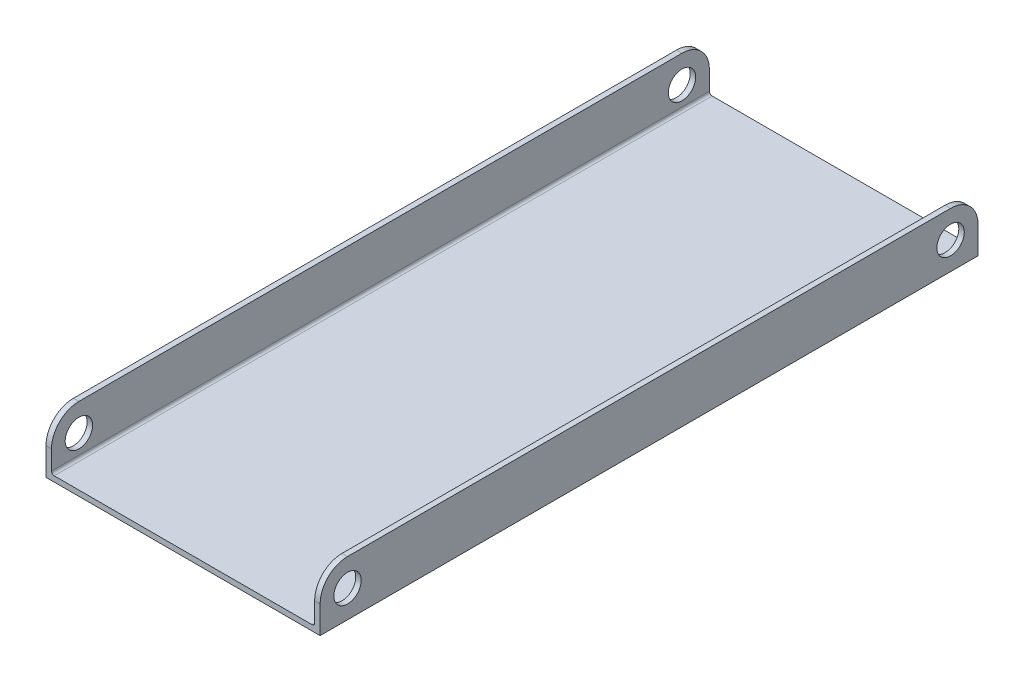
ISO-10303-21;
HEADER;
FILE_DESCRIPTION(('STEP AP214'),'2;1');
FILE_NAME('part.step','',(''),(''),'','','');
FILE_SCHEMA(('AUTOMOTIVE_DESIGN { 1 0 10303 214 1 1 1 1 }'));
ENDSEC;
DATA;
#1=APPLICATION_CONTEXT('core data for automotive mechanical design processes');
#2=APPLICATION_PROTOCOL_DEFINITION('international standard','automotive_design',2000,#1);
#3=PRODUCT_CONTEXT('',#1,'mechanical');
#4=PRODUCT('Part','Part','',(#3));
#5=PRODUCT_RELATED_PRODUCT_CATEGORY('part','',(#4));
#6=PRODUCT_DEFINITION_FORMATION('','',#4);
#7=PRODUCT_DEFINITION_CONTEXT('part definition',#1,'design');
#8=PRODUCT_DEFINITION('design','',#6,#7);
#9=PRODUCT_DEFINITION_SHAPE('','',#8);
#10=(LENGTH_UNIT() NAMED_UNIT(*) SI_UNIT(.MILLI.,.METRE.));
#11=(NAMED_UNIT(*) PLANE_ANGLE_UNIT() SI_UNIT($,.RADIAN.));
#12=(NAMED_UNIT(*) SI_UNIT($,.STERADIAN.) SOLID_ANGLE_UNIT());
#13=UNCERTAINTY_MEASURE_WITH_UNIT(LENGTH_MEASURE(1.E-05),#10,'distance_accuracy_value','');
#14=(GEOMETRIC_REPRESENTATION_CONTEXT(3) GLOBAL_UNCERTAINTY_ASSIGNED_CONTEXT((#13)) GLOBAL_UNIT_ASSIGNED_CONTEXT((#10,
#11,#12)) REPRESENTATION_CONTEXT('',''));
#15=CARTESIAN_POINT('',(0.,0.,0.));
#16=DIRECTION('',(0.,0.,1.));
#17=DIRECTION('',(1.,0.,0.));
#18=AXIS2_PLACEMENT_3D('',#15,#16,#17);
#19=CARTESIAN_POINT('',(0.,6.35,152.4));
#20=DIRECTION('',(0.,1.,0.));
#21=DIRECTION('',(0.,0.,1.));
#22=AXIS2_PLACEMENT_3D('',#19,#20,#21);
#23=PLANE('',#22);
#24=DIRECTION('',(0.,0.,-1.));
#25=VECTOR('',#24,1.);
#26=CARTESIAN_POINT('',(31.75,6.35,152.4));
#27=LINE('',#26,#25);
#28=CARTESIAN_POINT('',(31.75,6.35,146.05));
#29=VERTEX_POINT('',#28);
#30=CARTESIAN_POINT('',(31.75,6.35,6.35000000000005));
#31=VERTEX_POINT('',#30);
#32=EDGE_CURVE('E184',#29,#31,#27,.T.);
#33=ORIENTED_EDGE('',*,*,#32,.T.);
#34=DIRECTION('',(1.,0.,0.));
#35=VECTOR('',#34,1.);
#36=CARTESIAN_POINT('',(30.48,6.35,6.35));
#37=LINE('',#36,#35);
#38=CARTESIAN_POINT('',(30.48,6.35,6.35000000000005));
#39=VERTEX_POINT('',#38);
#40=EDGE_CURVE('E260',#31,#39,#37,.F.);
#41=ORIENTED_EDGE('',*,*,#40,.T.);
#42=DIRECTION('',(0.,0.,-1.));
#43=VECTOR('',#42,1.);
#44=CARTESIAN_POINT('',(30.48,6.35,152.4));
#45=LINE('',#44,#43);
#46=CARTESIAN_POINT('',(30.48,6.35,146.05));
#47=VERTEX_POINT('',#46);
#48=EDGE_CURVE('E219',#47,#39,#45,.T.);
#49=ORIENTED_EDGE('',*,*,#48,.F.);
#50=DIRECTION('',(1.,0.,0.));
#51=VECTOR('',#50,1.);
#52=CARTESIAN_POINT('',(0.,6.35,146.05));
#53=LINE('',#52,#51);
#54=EDGE_CURVE('E256',#47,#29,#53,.T.);
#55=ORIENTED_EDGE('',*,*,#54,.T.);
#56=EDGE_LOOP('',(#33,#41,#49,#55));
#57=FACE_BOUND('',#56,.T.);
#58=ADVANCED_FACE('F45',(#57),#23,.T.);
#59=CARTESIAN_POINT('',(30.48,0.,152.4));
#60=DIRECTION('',(1.,0.,0.));
#61=DIRECTION('',(0.,0.,-1.));
#62=AXIS2_PLACEMENT_3D('',#59,#60,#61);
#63=PLANE('',#62);
#64=CARTESIAN_POINT('',(30.48,0.,146.05));
#65=DIRECTION('',(1.,0.,0.));
#66=DIRECTION('',(0.,0.,-1.));
#67=AXIS2_PLACEMENT_3D('',#64,#65,#66);
#68=CIRCLE('',#67,3.175);
#69=CARTESIAN_POINT('',(30.48,0.,142.875));
#70=VERTEX_POINT('',#69);
#71=EDGE_CURVE('E190',#70,#70,#68,.T.);
#72=ORIENTED_EDGE('',*,*,#71,.T.);
#73=EDGE_LOOP('',(#72));
#74=FACE_BOUND('',#73,.T.);
#75=CARTESIAN_POINT('',(30.48,0.,6.34999999999999));
#76=DIRECTION('',(1.,0.,0.));
#77=DIRECTION('',(0.,0.,-1.));
#78=AXIS2_PLACEMENT_3D('',#75,#76,#77);
#79=CIRCLE('',#78,3.175);
#80=CARTESIAN_POINT('',(30.48,0.,3.175));
#81=VERTEX_POINT('',#80);
#82=EDGE_CURVE('E351',#81,#81,#79,.T.);
#83=ORIENTED_EDGE('',*,*,#82,.T.);
#84=EDGE_LOOP('',(#83));
#85=FACE_BOUND('',#84,.T.);
#86=DIRECTION('',(0.,-1.,0.));
#87=VECTOR('',#86,1.);
#88=CARTESIAN_POINT('',(30.48,0.,0.));
#89=LINE('',#88,#87);
#90=CARTESIAN_POINT('',(30.48,0.,0.));
#91=VERTEX_POINT('',#90);
#92=CARTESIAN_POINT('',(30.48,-4.445,0.));
#93=VERTEX_POINT('',#92);
#94=EDGE_CURVE('E185',#91,#93,#89,.T.);
#95=ORIENTED_EDGE('',*,*,#94,.T.);
#96=DIRECTION('',(0.,0.,-1.));
#97=VECTOR('',#96,1.);
#98=CARTESIAN_POINT('',(30.48,-4.445,152.4));
#99=LINE('',#98,#97);
#100=CARTESIAN_POINT('',(30.48,-4.445,152.4));
#101=VERTEX_POINT('',#100);
#102=EDGE_CURVE('E281',#93,#101,#99,.F.);
#103=ORIENTED_EDGE('',*,*,#102,.T.);
#104=DIRECTION('',(0.,-1.,0.));
#105=VECTOR('',#104,1.);
#106=CARTESIAN_POINT('',(30.48,0.,152.4));
#107=LINE('',#106,#105);
#108=CARTESIAN_POINT('',(30.48,0.,152.4));
#109=VERTEX_POINT('',#108);
#110=EDGE_CURVE('E207',#109,#101,#107,.T.);
#111=ORIENTED_EDGE('',*,*,#110,.F.);
#112=CARTESIAN_POINT('',(30.48,0.,146.05));
#113=DIRECTION('',(1.,0.,0.));
#114=DIRECTION('',(0.,0.,-1.));
#115=AXIS2_PLACEMENT_3D('',#112,#113,#114);
#116=CIRCLE('',#115,6.35);
#117=EDGE_CURVE('E263',#109,#47,#116,.F.);
#118=ORIENTED_EDGE('',*,*,#117,.T.);
#119=ORIENTED_EDGE('',*,*,#48,.T.);
#120=CARTESIAN_POINT('',(30.48,0.,6.35));
#121=DIRECTION('',(1.,0.,0.));
#122=DIRECTION('',(0.,0.,-1.));
#123=AXIS2_PLACEMENT_3D('',#120,#121,#122);
#124=CIRCLE('',#123,6.35);
#125=EDGE_CURVE('E266',#39,#91,#124,.F.);
#126=ORIENTED_EDGE('',*,*,#125,.T.);
#127=EDGE_LOOP('',(#95,#103,#111,#118,#119,#126));
#128=FACE_BOUND('',#127,.T.);
#129=ADVANCED_FACE('F328',(#74,#85,#128),#63,.F.);
#130=CARTESIAN_POINT('',(0.,-5.08,152.4));
#131=DIRECTION('',(0.,1.,0.));
#132=DIRECTION('',(-1.,0.,0.));
#133=AXIS2_PLACEMENT_3D('',#130,#131,#132);
#134=PLANE('',#133);
#135=DIRECTION('',(1.,0.,0.));
#136=VECTOR('',#135,1.);
#137=CARTESIAN_POINT('',(0.,-5.08,152.4));
#138=LINE('',#137,#136);
#139=CARTESIAN_POINT('',(-29.845,-5.08,152.4));
#140=VERTEX_POINT('',#139);
#141=CARTESIAN_POINT('',(29.845,-5.08,152.4));
#142=VERTEX_POINT('',#141);
#143=EDGE_CURVE('E178',#140,#142,#138,.T.);
#144=ORIENTED_EDGE('',*,*,#143,.T.);
#145=DIRECTION('',(0.,0.,-1.));
#146=VECTOR('',#145,1.);
#147=CARTESIAN_POINT('',(29.845,-5.08,152.4));
#148=LINE('',#147,#146);
#149=CARTESIAN_POINT('',(29.845,-5.08,0.));
#150=VERTEX_POINT('',#149);
#151=EDGE_CURVE('E277',#142,#150,#148,.T.);
#152=ORIENTED_EDGE('',*,*,#151,.T.);
#153=DIRECTION('',(1.,0.,0.));
#154=VECTOR('',#153,1.);
#155=CARTESIAN_POINT('',(0.,-5.08,0.));
#156=LINE('',#155,#154);
#157=CARTESIAN_POINT('',(-29.845,-5.08,0.));
#158=VERTEX_POINT('',#157);
#159=EDGE_CURVE('E189',#158,#150,#156,.T.);
#160=ORIENTED_EDGE('',*,*,#159,.F.);
#161=DIRECTION('',(0.,0.,-1.));
#162=VECTOR('',#161,1.);
#163=CARTESIAN_POINT('',(-29.845,-5.08,152.4));
#164=LINE('',#163,#162);
#165=EDGE_CURVE('E274',#158,#140,#164,.F.);
#166=ORIENTED_EDGE('',*,*,#165,.T.);
#167=EDGE_LOOP('',(#144,#152,#160,#166));
#168=FACE_BOUND('',#167,.T.);
#169=ADVANCED_FACE('F299',(#168),#134,.T.);
#170=CARTESIAN_POINT('',(-30.48,0.,152.4));
#171=DIRECTION('',(1.,0.,0.));
#172=DIRECTION('',(0.,0.,-1.));
#173=AXIS2_PLACEMENT_3D('',#170,#171,#172);
#174=PLANE('',#173);
#175=CARTESIAN_POINT('',(-30.48,0.,146.05));
#176=DIRECTION('',(1.,0.,0.));
#177=DIRECTION('',(0.,0.,-1.));
#178=AXIS2_PLACEMENT_3D('',#175,#176,#177);
#179=CIRCLE('',#178,3.175);
#180=CARTESIAN_POINT('',(-30.48,0.,142.875));
#181=VERTEX_POINT('',#180);
#182=EDGE_CURVE('E347',#181,#181,#179,.T.);
#183=ORIENTED_EDGE('',*,*,#182,.F.);
#184=EDGE_LOOP('',(#183));
#185=FACE_BOUND('',#184,.T.);
#186=CARTESIAN_POINT('',(-30.48,0.,6.34999999999999));
#187=DIRECTION('',(1.,0.,0.));
#188=DIRECTION('',(0.,0.,-1.));
#189=AXIS2_PLACEMENT_3D('',#186,#187,#188);
#190=CIRCLE('',#189,3.175);
#191=CARTESIAN_POINT('',(-30.48,0.,3.175));
#192=VERTEX_POINT('',#191);
#193=EDGE_CURVE('E355',#192,#192,#190,.T.);
#194=ORIENTED_EDGE('',*,*,#193,.F.);
#195=EDGE_LOOP('',(#194));
#196=FACE_BOUND('',#195,.T.);
#197=DIRECTION('',(0.,-1.,0.));
#198=VECTOR('',#197,1.);
#199=CARTESIAN_POINT('',(-30.48,0.,152.4));
#200=LINE('',#199,#198);
#201=CARTESIAN_POINT('',(-30.48,0.,152.4));
#202=VERTEX_POINT('',#201);
#203=CARTESIAN_POINT('',(-30.48,-4.445,152.4));
#204=VERTEX_POINT('',#203);
#205=EDGE_CURVE('E175',#202,#204,#200,.T.);
#206=ORIENTED_EDGE('',*,*,#205,.T.);
#207=DIRECTION('',(0.,0.,-1.));
#208=VECTOR('',#207,1.);
#209=CARTESIAN_POINT('',(-30.48,-4.445,0.));
#210=LINE('',#209,#208);
#211=CARTESIAN_POINT('',(-30.48,-4.445,0.));
#212=VERTEX_POINT('',#211);
#213=EDGE_CURVE('E284',#204,#212,#210,.T.);
#214=ORIENTED_EDGE('',*,*,#213,.T.);
#215=DIRECTION('',(0.,-1.,0.));
#216=VECTOR('',#215,1.);
#217=CARTESIAN_POINT('',(-30.48,0.,0.));
#218=LINE('',#217,#216);
#219=CARTESIAN_POINT('',(-30.48,0.,0.));
#220=VERTEX_POINT('',#219);
#221=EDGE_CURVE('E194',#220,#212,#218,.T.);
#222=ORIENTED_EDGE('',*,*,#221,.F.);
#223=CARTESIAN_POINT('',(-30.48,0.,6.35));
#224=DIRECTION('',(1.,0.,0.));
#225=DIRECTION('',(0.,0.,-1.));
#226=AXIS2_PLACEMENT_3D('',#223,#224,#225);
#227=CIRCLE('',#226,6.35);
#228=CARTESIAN_POINT('',(-30.48,6.35,6.35000000000005));
#229=VERTEX_POINT('',#228);
#230=EDGE_CURVE('E234',#220,#229,#227,.T.);
#231=ORIENTED_EDGE('',*,*,#230,.T.);
#232=DIRECTION('',(0.,0.,-1.));
#233=VECTOR('',#232,1.);
#234=CARTESIAN_POINT('',(-30.48,6.35,152.4));
#235=LINE('',#234,#233);
#236=CARTESIAN_POINT('',(-30.48,6.35,146.05));
#237=VERTEX_POINT('',#236);
#238=EDGE_CURVE('E215',#237,#229,#235,.T.);
#239=ORIENTED_EDGE('',*,*,#238,.F.);
#240=CARTESIAN_POINT('',(-30.48,0.,146.05));
#241=DIRECTION('',(1.,0.,0.));
#242=DIRECTION('',(0.,0.,-1.));
#243=AXIS2_PLACEMENT_3D('',#240,#241,#242);
#244=CIRCLE('',#243,6.35);
#245=EDGE_CURVE('E231',#237,#202,#244,.T.);
#246=ORIENTED_EDGE('',*,*,#245,.T.);
#247=EDGE_LOOP('',(#206,#214,#222,#231,#239,#246));
#248=FACE_BOUND('',#247,.T.);
#249=ADVANCED_FACE('F302',(#185,#196,#248),#174,.T.);
#250=ORIENTED_EDGE('',*,*,#238,.T.);
#251=DIRECTION('',(1.,0.,0.));
#252=VECTOR('',#251,1.);
#253=CARTESIAN_POINT('',(-31.75,6.35,6.35));
#254=LINE('',#253,#252);
#255=CARTESIAN_POINT('',(-31.75,6.35,6.35000000000005));
#256=VERTEX_POINT('',#255);
#257=EDGE_CURVE('E241',#229,#256,#254,.F.);
#258=ORIENTED_EDGE('',*,*,#257,.T.);
#259=DIRECTION('',(0.,0.,-1.));
#260=VECTOR('',#259,1.);
#261=CARTESIAN_POINT('',(-31.75,6.35,152.4));
#262=LINE('',#261,#260);
#263=CARTESIAN_POINT('',(-31.75,6.35,146.05));
#264=VERTEX_POINT('',#263);
#265=EDGE_CURVE('E159',#264,#256,#262,.T.);
#266=ORIENTED_EDGE('',*,*,#265,.F.);
#267=DIRECTION('',(1.,0.,0.));
#268=VECTOR('',#267,1.);
#269=CARTESIAN_POINT('',(0.,6.35,146.05));
#270=LINE('',#269,#268);
#271=EDGE_CURVE('E237',#264,#237,#270,.T.);
#272=ORIENTED_EDGE('',*,*,#271,.T.);
#273=EDGE_LOOP('',(#250,#258,#266,#272));
#274=FACE_BOUND('',#273,.T.);
#275=ADVANCED_FACE('F310',(#274),#23,.T.);
#276=CARTESIAN_POINT('',(-31.75,0.,152.4));
#277=DIRECTION('',(-1.,0.,0.));
#278=DIRECTION('',(0.,0.,1.));
#279=AXIS2_PLACEMENT_3D('',#276,#277,#278);
#280=PLANE('',#279);
#281=CARTESIAN_POINT('',(-31.75,0.,146.05));
#282=DIRECTION('',(1.,0.,0.));
#283=DIRECTION('',(0.,0.,-1.));
#284=AXIS2_PLACEMENT_3D('',#281,#282,#283);
#285=CIRCLE('',#284,3.175);
#286=CARTESIAN_POINT('',(-31.75,0.,142.875));
#287=VERTEX_POINT('',#286);
#288=EDGE_CURVE('E359',#287,#287,#285,.T.);
#289=ORIENTED_EDGE('',*,*,#288,.T.);
#290=EDGE_LOOP('',(#289));
#291=FACE_BOUND('',#290,.T.);
#292=CARTESIAN_POINT('',(-31.75,0.,6.34999999999999));
#293=DIRECTION('',(1.,0.,0.));
#294=DIRECTION('',(0.,0.,1.));
#295=AXIS2_PLACEMENT_3D('',#292,#293,#294);
#296=CIRCLE('',#295,3.175);
#297=CARTESIAN_POINT('',(-31.75,0.,9.52499999999999));
#298=VERTEX_POINT('',#297);
#299=EDGE_CURVE('E360',#298,#298,#296,.T.);
#300=ORIENTED_EDGE('',*,*,#299,.T.);
#301=EDGE_LOOP('',(#300));
#302=FACE_BOUND('',#301,.T.);
#303=ORIENTED_EDGE('',*,*,#265,.T.);
#304=CARTESIAN_POINT('',(-31.75,0.,6.35));
#305=DIRECTION('',(-1.,0.,0.));
#306=DIRECTION('',(0.,0.,1.));
#307=AXIS2_PLACEMENT_3D('',#304,#305,#306);
#308=CIRCLE('',#307,6.35);
#309=CARTESIAN_POINT('',(-31.75,0.,0.));
#310=VERTEX_POINT('',#309);
#311=EDGE_CURVE('E247',#256,#310,#308,.T.);
#312=ORIENTED_EDGE('',*,*,#311,.T.);
#313=DIRECTION('',(0.,1.,0.));
#314=VECTOR('',#313,1.);
#315=CARTESIAN_POINT('',(-31.75,0.,0.));
#316=LINE('',#315,#314);
#317=CARTESIAN_POINT('',(-31.75,-6.35,0.));
#318=VERTEX_POINT('',#317);
#319=EDGE_CURVE('E155',#318,#310,#316,.T.);
#320=ORIENTED_EDGE('',*,*,#319,.F.);
#321=DIRECTION('',(0.,0.,-1.));
#322=VECTOR('',#321,1.);
#323=CARTESIAN_POINT('',(-31.75,-6.35,152.4));
#324=LINE('',#323,#322);
#325=CARTESIAN_POINT('',(-31.75,-6.35,152.4));
#326=VERTEX_POINT('',#325);
#327=EDGE_CURVE('E147',#326,#318,#324,.T.);
#328=ORIENTED_EDGE('',*,*,#327,.F.);
#329=DIRECTION('',(0.,1.,0.));
#330=VECTOR('',#329,1.);
#331=CARTESIAN_POINT('',(-31.75,0.,152.4));
#332=LINE('',#331,#330);
#333=CARTESIAN_POINT('',(-31.75,0.,152.4));
#334=VERTEX_POINT('',#333);
#335=EDGE_CURVE('E152',#326,#334,#332,.T.);
#336=ORIENTED_EDGE('',*,*,#335,.T.);
#337=CARTESIAN_POINT('',(-31.75,0.,146.05));
#338=DIRECTION('',(-1.,0.,0.));
#339=DIRECTION('',(0.,0.,1.));
#340=AXIS2_PLACEMENT_3D('',#337,#338,#339);
#341=CIRCLE('',#340,6.35);
#342=EDGE_CURVE('E244',#334,#264,#341,.T.);
#343=ORIENTED_EDGE('',*,*,#342,.T.);
#344=EDGE_LOOP('',(#303,#312,#320,#328,#336,#343));
#345=FACE_BOUND('',#344,.T.);
#346=ADVANCED_FACE('F150',(#291,#302,#345),#280,.T.);
#347=CARTESIAN_POINT('',(0.,-6.35,152.4));
#348=DIRECTION('',(0.,1.,0.));
#349=DIRECTION('',(-1.,0.,0.));
#350=AXIS2_PLACEMENT_3D('',#347,#348,#349);
#351=PLANE('',#350);
#352=DIRECTION('',(1.,0.,0.));
#353=VECTOR('',#352,1.);
#354=CARTESIAN_POINT('',(0.,-6.35,0.));
#355=LINE('',#354,#353);
#356=CARTESIAN_POINT('',(31.75,-6.35,0.));
#357=VERTEX_POINT('',#356);
#358=EDGE_CURVE('E200',#318,#357,#355,.T.);
#359=ORIENTED_EDGE('',*,*,#358,.T.);
#360=DIRECTION('',(0.,0.,-1.));
#361=VECTOR('',#360,1.);
#362=CARTESIAN_POINT('',(31.75,-6.35,152.4));
#363=LINE('',#362,#361);
#364=CARTESIAN_POINT('',(31.75,-6.35,152.4));
#365=VERTEX_POINT('',#364);
#366=EDGE_CURVE('E160',#365,#357,#363,.T.);
#367=ORIENTED_EDGE('',*,*,#366,.F.);
#368=DIRECTION('',(1.,0.,0.));
#369=VECTOR('',#368,1.);
#370=CARTESIAN_POINT('',(0.,-6.35,152.4));
#371=LINE('',#370,#369);
#372=EDGE_CURVE('E163',#326,#365,#371,.T.);
#373=ORIENTED_EDGE('',*,*,#372,.F.);
#374=ORIENTED_EDGE('',*,*,#327,.T.);
#375=EDGE_LOOP('',(#359,#367,#373,#374));
#376=FACE_BOUND('',#375,.T.);
#377=ADVANCED_FACE('F164',(#376),#351,.F.);
#378=CARTESIAN_POINT('',(31.75,0.,152.4));
#379=DIRECTION('',(-1.,0.,0.));
#380=DIRECTION('',(0.,0.,1.));
#381=AXIS2_PLACEMENT_3D('',#378,#379,#380);
#382=PLANE('',#381);
#383=CARTESIAN_POINT('',(31.75,0.,146.05));
#384=DIRECTION('',(1.,0.,0.));
#385=DIRECTION('',(0.,0.,-1.));
#386=AXIS2_PLACEMENT_3D('',#383,#384,#385);
#387=CIRCLE('',#386,3.175);
#388=CARTESIAN_POINT('',(31.75,0.,142.875));
#389=VERTEX_POINT('',#388);
#390=EDGE_CURVE('E368',#389,#389,#387,.T.);
#391=ORIENTED_EDGE('',*,*,#390,.F.);
#392=EDGE_LOOP('',(#391));
#393=FACE_BOUND('',#392,.T.);
#394=CARTESIAN_POINT('',(31.75,0.,6.34999999999999));
#395=DIRECTION('',(1.,0.,0.));
#396=DIRECTION('',(0.,0.,1.));
#397=AXIS2_PLACEMENT_3D('',#394,#395,#396);
#398=CIRCLE('',#397,3.175);
#399=CARTESIAN_POINT('',(31.75,0.,9.52499999999999));
#400=VERTEX_POINT('',#399);
#401=EDGE_CURVE('E364',#400,#400,#398,.T.);
#402=ORIENTED_EDGE('',*,*,#401,.F.);
#403=EDGE_LOOP('',(#402));
#404=FACE_BOUND('',#403,.T.);
#405=DIRECTION('',(0.,1.,0.));
#406=VECTOR('',#405,1.);
#407=CARTESIAN_POINT('',(31.75,0.,0.));
#408=LINE('',#407,#406);
#409=CARTESIAN_POINT('',(31.75,0.,0.));
#410=VERTEX_POINT('',#409);
#411=EDGE_CURVE('E203',#357,#410,#408,.T.);
#412=ORIENTED_EDGE('',*,*,#411,.T.);
#413=CARTESIAN_POINT('',(31.75,0.,6.35));
#414=DIRECTION('',(-1.,0.,0.));
#415=DIRECTION('',(0.,0.,1.));
#416=AXIS2_PLACEMENT_3D('',#413,#414,#415);
#417=CIRCLE('',#416,6.35);
#418=EDGE_CURVE('E253',#410,#31,#417,.F.);
#419=ORIENTED_EDGE('',*,*,#418,.T.);
#420=ORIENTED_EDGE('',*,*,#32,.F.);
#421=CARTESIAN_POINT('',(31.75,0.,146.05));
#422=DIRECTION('',(-1.,0.,0.));
#423=DIRECTION('',(0.,0.,1.));
#424=AXIS2_PLACEMENT_3D('',#421,#422,#423);
#425=CIRCLE('',#424,6.35);
#426=CARTESIAN_POINT('',(31.75,0.,152.4));
#427=VERTEX_POINT('',#426);
#428=EDGE_CURVE('E250',#29,#427,#425,.F.);
#429=ORIENTED_EDGE('',*,*,#428,.T.);
#430=DIRECTION('',(0.,1.,0.));
#431=VECTOR('',#430,1.);
#432=CARTESIAN_POINT('',(31.75,0.,152.4));
#433=LINE('',#432,#431);
#434=EDGE_CURVE('E169',#365,#427,#433,.T.);
#435=ORIENTED_EDGE('',*,*,#434,.F.);
#436=ORIENTED_EDGE('',*,*,#366,.T.);
#437=EDGE_LOOP('',(#412,#419,#420,#429,#435,#436));
#438=FACE_BOUND('',#437,.T.);
#439=ADVANCED_FACE('F317',(#393,#404,#438),#382,.F.);
#440=CARTESIAN_POINT('',(0.,0.,152.4));
#441=DIRECTION('',(0.,0.,1.));
#442=DIRECTION('',(1.,0.,0.));
#443=AXIS2_PLACEMENT_3D('',#440,#441,#442);
#444=PLANE('',#443);
#445=ORIENTED_EDGE('',*,*,#205,.F.);
#446=DIRECTION('',(1.,0.,0.));
#447=VECTOR('',#446,1.);
#448=CARTESIAN_POINT('',(0.,0.,152.4));
#449=LINE('',#448,#447);
#450=EDGE_CURVE('E173',#202,#334,#449,.F.);
#451=ORIENTED_EDGE('',*,*,#450,.T.);
#452=ORIENTED_EDGE('',*,*,#335,.F.);
#453=ORIENTED_EDGE('',*,*,#372,.T.);
#454=ORIENTED_EDGE('',*,*,#434,.T.);
#455=DIRECTION('',(1.,0.,0.));
#456=VECTOR('',#455,1.);
#457=CARTESIAN_POINT('',(0.,0.,152.4));
#458=LINE('',#457,#456);
#459=EDGE_CURVE('E269',#427,#109,#458,.F.);
#460=ORIENTED_EDGE('',*,*,#459,.T.);
#461=ORIENTED_EDGE('',*,*,#110,.T.);
#462=CARTESIAN_POINT('',(29.845,-4.445,152.4));
#463=DIRECTION('',(0.,0.,1.));
#464=DIRECTION('',(1.,0.,0.));
#465=AXIS2_PLACEMENT_3D('',#462,#463,#464);
#466=CIRCLE('',#465,0.635);
#467=EDGE_CURVE('E290',#101,#142,#466,.F.);
#468=ORIENTED_EDGE('',*,*,#467,.T.);
#469=ORIENTED_EDGE('',*,*,#143,.F.);
#470=CARTESIAN_POINT('',(-29.845,-4.445,152.4));
#471=DIRECTION('',(0.,0.,1.));
#472=DIRECTION('',(1.,0.,0.));
#473=AXIS2_PLACEMENT_3D('',#470,#471,#472);
#474=CIRCLE('',#473,0.635);
#475=EDGE_CURVE('E11',#140,#204,#474,.F.);
#476=ORIENTED_EDGE('',*,*,#475,.T.);
#477=EDGE_LOOP('',(#445,#451,#452,#453,#454,#460,#461,#468,#469,#476));
#478=FACE_BOUND('',#477,.T.);
#479=ADVANCED_FACE('F171',(#478),#444,.T.);
#480=CARTESIAN_POINT('',(0.,0.,0.));
#481=DIRECTION('',(0.,0.,1.));
#482=DIRECTION('',(1.,0.,0.));
#483=AXIS2_PLACEMENT_3D('',#480,#481,#482);
#484=PLANE('',#483);
#485=ORIENTED_EDGE('',*,*,#319,.T.);
#486=DIRECTION('',(1.,0.,0.));
#487=VECTOR('',#486,1.);
#488=CARTESIAN_POINT('',(-30.48,0.,0.));
#489=LINE('',#488,#487);
#490=EDGE_CURVE('E227',#310,#220,#489,.T.);
#491=ORIENTED_EDGE('',*,*,#490,.T.);
#492=ORIENTED_EDGE('',*,*,#221,.T.);
#493=CARTESIAN_POINT('',(-29.845,-4.445,0.));
#494=DIRECTION('',(0.,0.,1.));
#495=DIRECTION('',(1.,0.,0.));
#496=AXIS2_PLACEMENT_3D('',#493,#494,#495);
#497=CIRCLE('',#496,0.635);
#498=EDGE_CURVE('E54',#212,#158,#497,.T.);
#499=ORIENTED_EDGE('',*,*,#498,.T.);
#500=ORIENTED_EDGE('',*,*,#159,.T.);
#501=CARTESIAN_POINT('',(29.845,-4.445,0.));
#502=DIRECTION('',(0.,0.,1.));
#503=DIRECTION('',(1.,0.,0.));
#504=AXIS2_PLACEMENT_3D('',#501,#502,#503);
#505=CIRCLE('',#504,0.635);
#506=EDGE_CURVE('E287',#150,#93,#505,.T.);
#507=ORIENTED_EDGE('',*,*,#506,.T.);
#508=ORIENTED_EDGE('',*,*,#94,.F.);
#509=DIRECTION('',(1.,0.,0.));
#510=VECTOR('',#509,1.);
#511=CARTESIAN_POINT('',(31.75,0.,0.));
#512=LINE('',#511,#510);
#513=EDGE_CURVE('E223',#91,#410,#512,.T.);
#514=ORIENTED_EDGE('',*,*,#513,.T.);
#515=ORIENTED_EDGE('',*,*,#411,.F.);
#516=ORIENTED_EDGE('',*,*,#358,.F.);
#517=EDGE_LOOP('',(#485,#491,#492,#499,#500,#507,#508,#514,#515,#516));
#518=FACE_BOUND('',#517,.T.);
#519=ADVANCED_FACE('F295',(#518),#484,.F.);
#520=CARTESIAN_POINT('',(-31.75,0.,6.34999999999999));
#521=DIRECTION('',(1.,0.,0.));
#522=DIRECTION('',(0.,0.,-1.));
#523=AXIS2_PLACEMENT_3D('',#520,#521,#522);
#524=CYLINDRICAL_SURFACE('',#523,3.175);
#525=ORIENTED_EDGE('',*,*,#401,.T.);
#526=EDGE_LOOP('',(#525));
#527=FACE_BOUND('',#526,.T.);
#528=ORIENTED_EDGE('',*,*,#82,.F.);
#529=EDGE_LOOP('',(#528));
#530=FACE_BOUND('',#529,.T.);
#531=ADVANCED_FACE('F391',(#527,#530),#524,.F.);
#532=CARTESIAN_POINT('',(-31.75,0.,146.05));
#533=DIRECTION('',(1.,0.,0.));
#534=DIRECTION('',(0.,0.,-1.));
#535=AXIS2_PLACEMENT_3D('',#532,#533,#534);
#536=CYLINDRICAL_SURFACE('',#535,3.175);
#537=ORIENTED_EDGE('',*,*,#390,.T.);
#538=EDGE_LOOP('',(#537));
#539=FACE_BOUND('',#538,.T.);
#540=ORIENTED_EDGE('',*,*,#71,.F.);
#541=EDGE_LOOP('',(#540));
#542=FACE_BOUND('',#541,.T.);
#543=ADVANCED_FACE('F383',(#539,#542),#536,.F.);
#544=ORIENTED_EDGE('',*,*,#193,.T.);
#545=EDGE_LOOP('',(#544));
#546=FACE_BOUND('',#545,.T.);
#547=ORIENTED_EDGE('',*,*,#299,.F.);
#548=EDGE_LOOP('',(#547));
#549=FACE_BOUND('',#548,.T.);
#550=ADVANCED_FACE('F380',(#546,#549),#524,.F.);
#551=ORIENTED_EDGE('',*,*,#182,.T.);
#552=EDGE_LOOP('',(#551));
#553=FACE_BOUND('',#552,.T.);
#554=ORIENTED_EDGE('',*,*,#288,.F.);
#555=EDGE_LOOP('',(#554));
#556=FACE_BOUND('',#555,.T.);
#557=ADVANCED_FACE('F378',(#553,#556),#536,.F.);
#558=CARTESIAN_POINT('',(0.,0.,6.35));
#559=DIRECTION('',(-1.,0.,0.));
#560=DIRECTION('',(0.,0.,1.));
#561=AXIS2_PLACEMENT_3D('',#558,#559,#560);
#562=CYLINDRICAL_SURFACE('',#561,6.35);
#563=ORIENTED_EDGE('',*,*,#311,.F.);
#564=ORIENTED_EDGE('',*,*,#257,.F.);
#565=ORIENTED_EDGE('',*,*,#230,.F.);
#566=ORIENTED_EDGE('',*,*,#490,.F.);
#567=EDGE_LOOP('',(#563,#564,#565,#566));
#568=FACE_BOUND('',#567,.T.);
#569=ADVANCED_FACE('F313',(#568),#562,.T.);
#570=CARTESIAN_POINT('',(0.,0.,6.35));
#571=DIRECTION('',(-1.,0.,0.));
#572=DIRECTION('',(0.,0.,1.));
#573=AXIS2_PLACEMENT_3D('',#570,#571,#572);
#574=CYLINDRICAL_SURFACE('',#573,6.35);
#575=ORIENTED_EDGE('',*,*,#125,.F.);
#576=ORIENTED_EDGE('',*,*,#40,.F.);
#577=ORIENTED_EDGE('',*,*,#418,.F.);
#578=ORIENTED_EDGE('',*,*,#513,.F.);
#579=EDGE_LOOP('',(#575,#576,#577,#578));
#580=FACE_BOUND('',#579,.T.);
#581=ADVANCED_FACE('F333',(#580),#574,.T.);
#582=CARTESIAN_POINT('',(0.,0.,146.05));
#583=DIRECTION('',(1.,0.,0.));
#584=DIRECTION('',(0.,0.,-1.));
#585=AXIS2_PLACEMENT_3D('',#582,#583,#584);
#586=CYLINDRICAL_SURFACE('',#585,6.35);
#587=ORIENTED_EDGE('',*,*,#342,.F.);
#588=ORIENTED_EDGE('',*,*,#450,.F.);
#589=ORIENTED_EDGE('',*,*,#245,.F.);
#590=ORIENTED_EDGE('',*,*,#271,.F.);
#591=EDGE_LOOP('',(#587,#588,#589,#590));
#592=FACE_BOUND('',#591,.T.);
#593=ADVANCED_FACE('F305',(#592),#586,.T.);
#594=CARTESIAN_POINT('',(0.,0.,146.05));
#595=DIRECTION('',(1.,0.,0.));
#596=DIRECTION('',(0.,0.,-1.));
#597=AXIS2_PLACEMENT_3D('',#594,#595,#596);
#598=CYLINDRICAL_SURFACE('',#597,6.35);
#599=ORIENTED_EDGE('',*,*,#117,.F.);
#600=ORIENTED_EDGE('',*,*,#459,.F.);
#601=ORIENTED_EDGE('',*,*,#428,.F.);
#602=ORIENTED_EDGE('',*,*,#54,.F.);
#603=EDGE_LOOP('',(#599,#600,#601,#602));
#604=FACE_BOUND('',#603,.T.);
#605=ADVANCED_FACE('F324',(#604),#598,.T.);
#606=CARTESIAN_POINT('',(29.845,-4.445,152.4));
#607=DIRECTION('',(0.,0.,-1.));
#608=DIRECTION('',(-1.,0.,0.));
#609=AXIS2_PLACEMENT_3D('',#606,#607,#608);
#610=CYLINDRICAL_SURFACE('',#609,0.635);
#611=ORIENTED_EDGE('',*,*,#467,.F.);
#612=ORIENTED_EDGE('',*,*,#102,.F.);
#613=ORIENTED_EDGE('',*,*,#506,.F.);
#614=ORIENTED_EDGE('',*,*,#151,.F.);
#615=EDGE_LOOP('',(#611,#612,#613,#614));
#616=FACE_BOUND('',#615,.T.);
#617=ADVANCED_FACE('F339',(#616),#610,.F.);
#618=CARTESIAN_POINT('',(-29.845,-4.445,152.4));
#619=DIRECTION('',(0.,0.,1.));
#620=DIRECTION('',(1.,0.,0.));
#621=AXIS2_PLACEMENT_3D('',#618,#619,#620);
#622=CYLINDRICAL_SURFACE('',#621,0.635);
#623=ORIENTED_EDGE('',*,*,#475,.F.);
#624=ORIENTED_EDGE('',*,*,#165,.F.);
#625=ORIENTED_EDGE('',*,*,#498,.F.);
#626=ORIENTED_EDGE('',*,*,#213,.F.);
#627=EDGE_LOOP('',(#623,#624,#625,#626));
#628=FACE_BOUND('',#627,.T.);
#629=ADVANCED_FACE('F47',(#628),#622,.F.);
#630=CLOSED_SHELL('',(#58,#129,#169,#249,#275,#346,#377,#439,#479,#519,#531,#543,#550,#557,#569,
#581,#593,#605,#617,#629));
#631=MANIFOLD_SOLID_BREP('B2',#630);
#632=ADVANCED_BREP_SHAPE_REPRESENTATION('',(#18,#631),#14);
#633=SHAPE_DEFINITION_REPRESENTATION(#9,#632);
ENDSEC;
END-ISO-10303-21;
